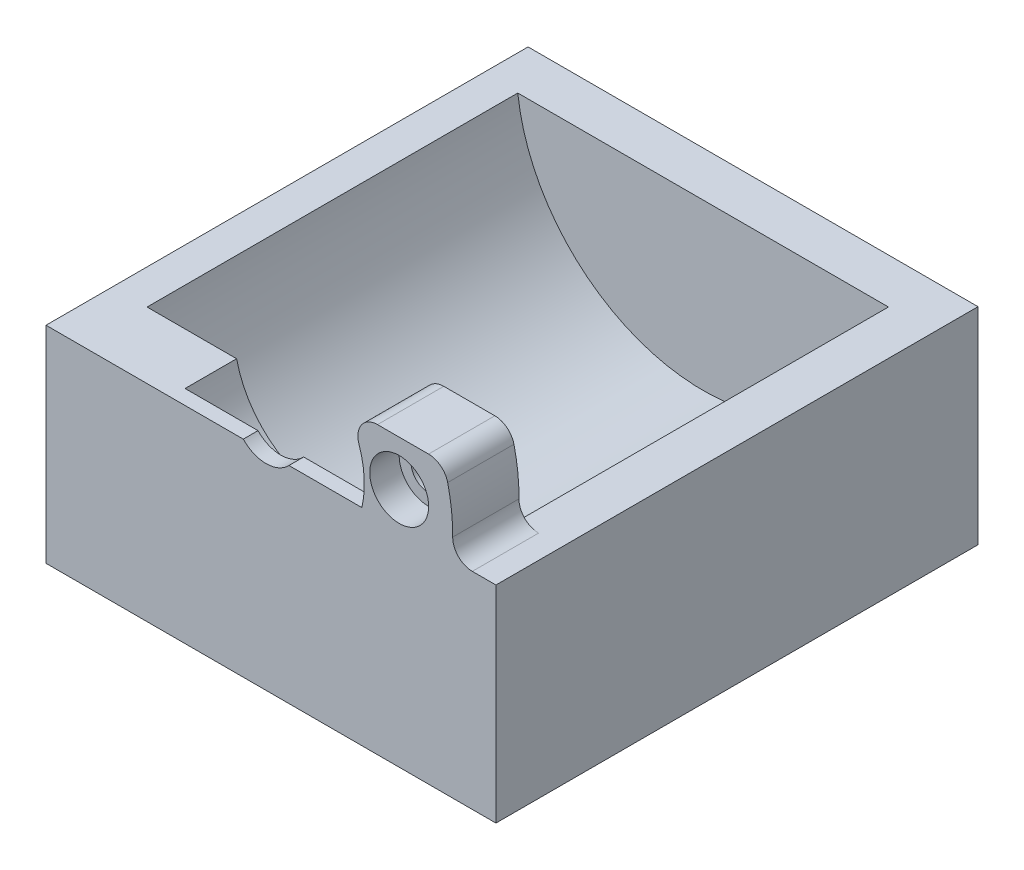
ISO-10303-21;
HEADER;
FILE_DESCRIPTION(('STEP AP214'),'2;1');
FILE_NAME('part.step','',(''),(''),'','','');
FILE_SCHEMA(('AUTOMOTIVE_DESIGN { 1 0 10303 214 1 1 1 1 }'));
ENDSEC;
DATA;
#1=APPLICATION_CONTEXT('core data for automotive mechanical design processes');
#2=APPLICATION_PROTOCOL_DEFINITION('international standard','automotive_design',2000,#1);
#3=PRODUCT_CONTEXT('',#1,'mechanical');
#4=PRODUCT('Part','Part','',(#3));
#5=PRODUCT_RELATED_PRODUCT_CATEGORY('part','',(#4));
#6=PRODUCT_DEFINITION_FORMATION('','',#4);
#7=PRODUCT_DEFINITION_CONTEXT('part definition',#1,'design');
#8=PRODUCT_DEFINITION('design','',#6,#7);
#9=PRODUCT_DEFINITION_SHAPE('','',#8);
#10=(LENGTH_UNIT() NAMED_UNIT(*) SI_UNIT(.MILLI.,.METRE.));
#11=(NAMED_UNIT(*) PLANE_ANGLE_UNIT() SI_UNIT($,.RADIAN.));
#12=(NAMED_UNIT(*) SI_UNIT($,.STERADIAN.) SOLID_ANGLE_UNIT());
#13=UNCERTAINTY_MEASURE_WITH_UNIT(LENGTH_MEASURE(1.E-05),#10,'distance_accuracy_value','');
#14=(GEOMETRIC_REPRESENTATION_CONTEXT(3) GLOBAL_UNCERTAINTY_ASSIGNED_CONTEXT((#13)) GLOBAL_UNIT_ASSIGNED_CONTEXT((#10,
#11,#12)) REPRESENTATION_CONTEXT('',''));
#15=CARTESIAN_POINT('',(0.,0.,0.));
#16=DIRECTION('',(0.,0.,1.));
#17=DIRECTION('',(1.,0.,0.));
#18=AXIS2_PLACEMENT_3D('',#15,#16,#17);
#19=CARTESIAN_POINT('',(-10.,0.,80.));
#20=DIRECTION('',(0.,0.,1.));
#21=DIRECTION('',(1.,0.,0.));
#22=AXIS2_PLACEMENT_3D('',#19,#20,#21);
#23=PLANE('',#22);
#24=DIRECTION('',(0.,-1.,0.));
#25=VECTOR('',#24,1.);
#26=CARTESIAN_POINT('',(69.7037540720334,60.4384133611691,80.));
#27=LINE('',#26,#25);
#28=CARTESIAN_POINT('',(69.7037540720334,10.4384133611691,80.));
#29=VERTEX_POINT('',#28);
#30=CARTESIAN_POINT('',(69.7037540720334,-10.5615866388309,80.));
#31=VERTEX_POINT('',#30);
#32=EDGE_CURVE('E206',#29,#31,#27,.T.);
#33=ORIENTED_EDGE('',*,*,#32,.T.);
#34=DIRECTION('',(-1.,0.,0.));
#35=VECTOR('',#34,1.);
#36=CARTESIAN_POINT('',(115.522386605031,-10.5615866388309,80.));
#37=LINE('',#36,#35);
#38=CARTESIAN_POINT('',(115.522386605031,-10.5615866388309,80.));
#39=VERTEX_POINT('',#38);
#40=EDGE_CURVE('E183',#39,#31,#37,.T.);
#41=ORIENTED_EDGE('',*,*,#40,.F.);
#42=DIRECTION('',(0.,-1.,0.));
#43=VECTOR('',#42,1.);
#44=CARTESIAN_POINT('',(115.522386605031,60.4384133611691,80.));
#45=LINE('',#44,#43);
#46=CARTESIAN_POINT('',(115.522386605031,10.4384133611691,80.));
#47=VERTEX_POINT('',#46);
#48=EDGE_CURVE('E203',#47,#39,#45,.T.);
#49=ORIENTED_EDGE('',*,*,#48,.F.);
#50=DIRECTION('',(-1.,0.,0.));
#51=VECTOR('',#50,1.);
#52=CARTESIAN_POINT('',(-92.8810020876827,10.4384133611691,80.));
#53=LINE('',#52,#51);
#54=CARTESIAN_POINT('',(113.118045509768,10.4384133611691,80.));
#55=VERTEX_POINT('',#54);
#56=EDGE_CURVE('E285',#47,#55,#53,.T.);
#57=ORIENTED_EDGE('',*,*,#56,.T.);
#58=CARTESIAN_POINT('',(113.118045509768,12.4384133611691,80.));
#59=DIRECTION('',(0.,0.,1.));
#60=DIRECTION('',(1.,0.,0.));
#61=AXIS2_PLACEMENT_3D('',#58,#59,#60);
#62=CIRCLE('',#61,2.);
#63=CARTESIAN_POINT('',(111.118136214773,12.4574609802167,80.));
#64=VERTEX_POINT('',#63);
#65=EDGE_CURVE('E329',#55,#64,#62,.F.);
#66=ORIENTED_EDGE('',*,*,#65,.T.);
#67=CARTESIAN_POINT('',(92.1189979123148,12.6384133611689,80.));
#68=DIRECTION('',(0.,0.,1.));
#69=DIRECTION('',(-1.,0.,0.));
#70=AXIS2_PLACEMENT_3D('',#67,#68,#69);
#71=CIRCLE('',#70,19.0000000000024);
#72=CARTESIAN_POINT('',(110.608046564802,17.0150650409405,80.));
#73=VERTEX_POINT('',#72);
#74=EDGE_CURVE('E227',#64,#73,#71,.T.);
#75=ORIENTED_EDGE('',*,*,#74,.T.);
#76=CARTESIAN_POINT('',(108.661830917172,16.5543648641225,80.));
#77=DIRECTION('',(0.,0.,1.));
#78=DIRECTION('',(1.,0.,0.));
#79=AXIS2_PLACEMENT_3D('',#76,#77,#78);
#80=CIRCLE('',#79,2.);
#81=CARTESIAN_POINT('',(108.661830917172,18.5543648641225,80.));
#82=VERTEX_POINT('',#81);
#83=EDGE_CURVE('E301',#73,#82,#80,.T.);
#84=ORIENTED_EDGE('',*,*,#83,.T.);
#85=DIRECTION('',(-1.,0.,0.));
#86=VECTOR('',#85,1.);
#87=CARTESIAN_POINT('',(100.181349790938,18.5543648641225,80.));
#88=LINE('',#87,#86);
#89=CARTESIAN_POINT('',(103.462071738513,18.5543648641225,80.));
#90=VERTEX_POINT('',#89);
#91=EDGE_CURVE('E223',#82,#90,#88,.T.);
#92=ORIENTED_EDGE('',*,*,#91,.T.);
#93=CARTESIAN_POINT('',(103.462071738513,16.5543648641225,80.));
#94=DIRECTION('',(0.,0.,1.));
#95=DIRECTION('',(1.,0.,0.));
#96=AXIS2_PLACEMENT_3D('',#93,#94,#95);
#97=CIRCLE('',#96,2.);
#98=CARTESIAN_POINT('',(101.571559434147,15.9017062802969,80.));
#99=VERTEX_POINT('',#98);
#100=EDGE_CURVE('E304',#90,#99,#97,.T.);
#101=ORIENTED_EDGE('',*,*,#100,.T.);
#102=CARTESIAN_POINT('',(92.1189979123168,12.638413361169,80.));
#103=DIRECTION('',(0.,0.,-1.));
#104=DIRECTION('',(-1.,0.,0.));
#105=AXIS2_PLACEMENT_3D('',#102,#103,#104);
#106=CIRCLE('',#105,10.0000000000004);
#107=CARTESIAN_POINT('',(101.873996630923,10.4384133611691,80.));
#108=VERTEX_POINT('',#107);
#109=EDGE_CURVE('E232',#99,#108,#106,.T.);
#110=ORIENTED_EDGE('',*,*,#109,.T.);
#111=CARTESIAN_POINT('',(94.4427879200417,10.4384133611691,80.));
#112=VERTEX_POINT('',#111);
#113=EDGE_CURVE('E289',#108,#112,#53,.T.);
#114=ORIENTED_EDGE('',*,*,#113,.T.);
#115=CARTESIAN_POINT('',(92.1189979123173,12.6384133611691,80.));
#116=DIRECTION('',(0.,0.,1.));
#117=DIRECTION('',(1.,0.,0.));
#118=AXIS2_PLACEMENT_3D('',#115,#116,#117);
#119=CIRCLE('',#118,3.2);
#120=CARTESIAN_POINT('',(89.7952079045928,10.4384133611691,80.));
#121=VERTEX_POINT('',#120);
#122=EDGE_CURVE('E248',#121,#112,#119,.T.);
#123=ORIENTED_EDGE('',*,*,#122,.F.);
#124=EDGE_CURVE('E284',#121,#29,#53,.T.);
#125=ORIENTED_EDGE('',*,*,#124,.T.);
#126=EDGE_LOOP('',(#33,#41,#49,#57,#66,#75,#84,#92,#101,#110,#114,#123,#125));
#127=FACE_BOUND('',#126,.T.);
#128=CARTESIAN_POINT('',(105.669337757458,13.9384133611691,80.));
#129=DIRECTION('',(0.,0.,1.));
#130=DIRECTION('',(1.,0.,0.));
#131=AXIS2_PLACEMENT_3D('',#128,#129,#130);
#132=CIRCLE('',#131,3.00000000000001);
#133=CARTESIAN_POINT('',(108.669337757458,13.9384133611691,80.));
#134=VERTEX_POINT('',#133);
#135=EDGE_CURVE('E210',#134,#134,#132,.T.);
#136=ORIENTED_EDGE('',*,*,#135,.F.);
#137=EDGE_LOOP('',(#136));
#138=FACE_BOUND('',#137,.T.);
#139=ADVANCED_FACE('F51',(#127,#138),#23,.T.);
#140=CARTESIAN_POINT('',(-92.8810020876827,10.4384133611691,80.));
#141=DIRECTION('',(0.,-1.,0.));
#142=DIRECTION('',(0.,0.,-1.));
#143=AXIS2_PLACEMENT_3D('',#140,#141,#142);
#144=PLANE('',#143);
#145=DIRECTION('',(-1.,0.,0.));
#146=VECTOR('',#145,1.);
#147=CARTESIAN_POINT('',(73.2467961329805,10.4384133611691,35.5));
#148=LINE('',#147,#146);
#149=CARTESIAN_POINT('',(110.991199691654,10.4384133611691,35.5));
#150=VERTEX_POINT('',#149);
#151=CARTESIAN_POINT('',(73.2467961329805,10.4384133611691,35.5));
#152=VERTEX_POINT('',#151);
#153=EDGE_CURVE('E345',#150,#152,#148,.T.);
#154=ORIENTED_EDGE('',*,*,#153,.F.);
#155=DIRECTION('',(0.,0.,1.));
#156=VECTOR('',#155,1.);
#157=CARTESIAN_POINT('',(110.991199691654,10.4384133611691,38.5));
#158=LINE('',#157,#156);
#159=CARTESIAN_POINT('',(110.991199691654,10.4384133611691,73.25));
#160=VERTEX_POINT('',#159);
#161=EDGE_CURVE('E281',#150,#160,#158,.T.);
#162=ORIENTED_EDGE('',*,*,#161,.T.);
#163=DIRECTION('',(1.,0.,0.));
#164=VECTOR('',#163,1.);
#165=CARTESIAN_POINT('',(92.1189979123173,10.4384133611691,73.25));
#166=LINE('',#165,#164);
#167=CARTESIAN_POINT('',(113.118045509768,10.4384133611691,73.25));
#168=VERTEX_POINT('',#167);
#169=EDGE_CURVE('E67',#160,#168,#166,.T.);
#170=ORIENTED_EDGE('',*,*,#169,.T.);
#171=DIRECTION('',(0.,0.,1.));
#172=VECTOR('',#171,1.);
#173=CARTESIAN_POINT('',(113.118045509768,10.4384133611691,80.));
#174=LINE('',#173,#172);
#175=EDGE_CURVE('E318',#168,#55,#174,.T.);
#176=ORIENTED_EDGE('',*,*,#175,.T.);
#177=ORIENTED_EDGE('',*,*,#56,.F.);
#178=DIRECTION('',(0.,0.,-1.));
#179=VECTOR('',#178,1.);
#180=CARTESIAN_POINT('',(115.522386605031,10.4384133611691,80.));
#181=LINE('',#180,#179);
#182=CARTESIAN_POINT('',(115.522386605031,10.4384133611691,30.9091006022906));
#183=VERTEX_POINT('',#182);
#184=EDGE_CURVE('E60',#47,#183,#181,.T.);
#185=ORIENTED_EDGE('',*,*,#184,.T.);
#186=DIRECTION('',(1.,0.,0.));
#187=VECTOR('',#186,1.);
#188=CARTESIAN_POINT('',(69.7037540720334,10.4384133611691,30.9091006022906));
#189=LINE('',#188,#187);
#190=CARTESIAN_POINT('',(69.7037540720334,10.4384133611691,30.9091006022906));
#191=VERTEX_POINT('',#190);
#192=EDGE_CURVE('E195',#191,#183,#189,.T.);
#193=ORIENTED_EDGE('',*,*,#192,.F.);
#194=DIRECTION('',(0.,0.,-1.));
#195=VECTOR('',#194,1.);
#196=CARTESIAN_POINT('',(69.7037540720334,10.4384133611691,80.));
#197=LINE('',#196,#195);
#198=EDGE_CURVE('E11',#29,#191,#197,.T.);
#199=ORIENTED_EDGE('',*,*,#198,.F.);
#200=ORIENTED_EDGE('',*,*,#124,.F.);
#201=DIRECTION('',(0.,0.,-1.));
#202=VECTOR('',#201,1.);
#203=CARTESIAN_POINT('',(89.7952079045928,10.4384133611691,118.5));
#204=LINE('',#203,#202);
#205=CARTESIAN_POINT('',(89.7952079045928,10.4384133611691,78.5));
#206=VERTEX_POINT('',#205);
#207=EDGE_CURVE('E256',#121,#206,#204,.T.);
#208=ORIENTED_EDGE('',*,*,#207,.T.);
#209=DIRECTION('',(1.,0.,0.));
#210=VECTOR('',#209,1.);
#211=CARTESIAN_POINT('',(-92.8810020876827,10.4384133611691,78.5));
#212=LINE('',#211,#210);
#213=CARTESIAN_POINT('',(82.3639991937115,10.4384133611691,78.5));
#214=VERTEX_POINT('',#213);
#215=EDGE_CURVE('E290',#214,#206,#212,.T.);
#216=ORIENTED_EDGE('',*,*,#215,.F.);
#217=DIRECTION('',(0.,0.,-1.));
#218=VECTOR('',#217,1.);
#219=CARTESIAN_POINT('',(82.3639991937115,10.4384133611691,78.5));
#220=LINE('',#219,#218);
#221=CARTESIAN_POINT('',(82.3639991937115,10.4384133611691,73.25));
#222=VERTEX_POINT('',#221);
#223=EDGE_CURVE('E265',#214,#222,#220,.T.);
#224=ORIENTED_EDGE('',*,*,#223,.T.);
#225=DIRECTION('',(-1.,0.,0.));
#226=VECTOR('',#225,1.);
#227=CARTESIAN_POINT('',(73.2467961329805,10.4384133611691,73.25));
#228=LINE('',#227,#226);
#229=CARTESIAN_POINT('',(73.2467961329805,10.4384133611691,73.25));
#230=VERTEX_POINT('',#229);
#231=EDGE_CURVE('E271',#222,#230,#228,.T.);
#232=ORIENTED_EDGE('',*,*,#231,.T.);
#233=DIRECTION('',(0.,0.,1.));
#234=VECTOR('',#233,1.);
#235=CARTESIAN_POINT('',(73.2467961329805,10.4384133611691,38.5));
#236=LINE('',#235,#234);
#237=EDGE_CURVE('E278',#230,#152,#236,.F.);
#238=ORIENTED_EDGE('',*,*,#237,.T.);
#239=EDGE_LOOP('',(#154,#162,#170,#176,#177,#185,#193,#199,#200,#208,#216,#224,#232,#238));
#240=FACE_BOUND('',#239,.T.);
#241=ADVANCED_FACE('F340',(#240),#144,.F.);
#242=CARTESIAN_POINT('',(105.669337757458,13.9384133611691,73.25));
#243=DIRECTION('',(0.,0.,1.));
#244=DIRECTION('',(1.,0.,0.));
#245=AXIS2_PLACEMENT_3D('',#242,#243,#244);
#246=CYLINDRICAL_SURFACE('',#245,1.79999999999999);
#247=CARTESIAN_POINT('',(105.669337757458,13.9384133611691,73.25));
#248=DIRECTION('',(0.,0.,1.));
#249=DIRECTION('',(1.,0.,0.));
#250=AXIS2_PLACEMENT_3D('',#247,#248,#249);
#251=CIRCLE('',#250,1.79999999999999);
#252=CARTESIAN_POINT('',(107.469337757458,13.9384133611691,73.25));
#253=VERTEX_POINT('',#252);
#254=EDGE_CURVE('E235',#253,#253,#251,.T.);
#255=ORIENTED_EDGE('',*,*,#254,.F.);
#256=EDGE_LOOP('',(#255));
#257=FACE_BOUND('',#256,.T.);
#258=CARTESIAN_POINT('',(105.669337757458,13.9384133611691,77.));
#259=DIRECTION('',(0.,0.,1.));
#260=DIRECTION('',(1.,0.,0.));
#261=AXIS2_PLACEMENT_3D('',#258,#259,#260);
#262=CIRCLE('',#261,1.79999999999999);
#263=CARTESIAN_POINT('',(107.469337757458,13.9384133611691,77.));
#264=VERTEX_POINT('',#263);
#265=EDGE_CURVE('E214',#264,#264,#262,.F.);
#266=ORIENTED_EDGE('',*,*,#265,.F.);
#267=EDGE_LOOP('',(#266));
#268=FACE_BOUND('',#267,.T.);
#269=ADVANCED_FACE('F419',(#257,#268),#246,.F.);
#270=CARTESIAN_POINT('',(92.1189979123173,12.6384133611691,38.5));
#271=DIRECTION('',(0.,0.,1.));
#272=DIRECTION('',(1.,0.,0.));
#273=AXIS2_PLACEMENT_3D('',#270,#271,#272);
#274=CYLINDRICAL_SURFACE('',#273,19.);
#275=CARTESIAN_POINT('',(92.1189979123173,12.6384133611691,73.25));
#276=DIRECTION('',(0.,0.,1.));
#277=DIRECTION('',(1.,0.,0.));
#278=AXIS2_PLACEMENT_3D('',#275,#276,#277);
#279=CIRCLE('',#278,19.);
#280=EDGE_CURVE('E274',#230,#160,#279,.T.);
#281=ORIENTED_EDGE('',*,*,#280,.T.);
#282=ORIENTED_EDGE('',*,*,#161,.F.);
#283=CARTESIAN_POINT('',(92.1189979123173,12.6384133611691,35.5));
#284=DIRECTION('',(0.,0.,1.));
#285=DIRECTION('',(1.,0.,0.));
#286=AXIS2_PLACEMENT_3D('',#283,#284,#285);
#287=CIRCLE('',#286,19.);
#288=EDGE_CURVE('E185',#152,#150,#287,.T.);
#289=ORIENTED_EDGE('',*,*,#288,.F.);
#290=ORIENTED_EDGE('',*,*,#237,.F.);
#291=EDGE_LOOP('',(#281,#282,#289,#290));
#292=FACE_BOUND('',#291,.T.);
#293=ADVANCED_FACE('F424',(#292),#274,.F.);
#294=CARTESIAN_POINT('',(92.1189979123173,12.6384133611691,73.25));
#295=DIRECTION('',(0.,0.,1.));
#296=DIRECTION('',(1.,0.,0.));
#297=AXIS2_PLACEMENT_3D('',#294,#295,#296);
#298=PLANE('',#297);
#299=CARTESIAN_POINT('',(92.1189979123173,12.6384133611691,73.25));
#300=DIRECTION('',(0.,0.,-1.));
#301=DIRECTION('',(-1.,0.,0.));
#302=AXIS2_PLACEMENT_3D('',#299,#300,#301);
#303=CIRCLE('',#302,9.99999999999999);
#304=CARTESIAN_POINT('',(101.571559434147,15.901706280297,73.25));
#305=VERTEX_POINT('',#304);
#306=EDGE_CURVE('E260',#305,#222,#303,.T.);
#307=ORIENTED_EDGE('',*,*,#306,.F.);
#308=CARTESIAN_POINT('',(103.462071738513,16.5543648641225,73.25));
#309=DIRECTION('',(0.,0.,1.));
#310=DIRECTION('',(1.,0.,0.));
#311=AXIS2_PLACEMENT_3D('',#308,#309,#310);
#312=CIRCLE('',#311,2.);
#313=CARTESIAN_POINT('',(103.462071738513,18.5543648641225,73.25));
#314=VERTEX_POINT('',#313);
#315=EDGE_CURVE('E313',#305,#314,#312,.F.);
#316=ORIENTED_EDGE('',*,*,#315,.T.);
#317=DIRECTION('',(-1.,0.,0.));
#318=VECTOR('',#317,1.);
#319=CARTESIAN_POINT('',(100.181349790938,18.5543648641225,73.25));
#320=LINE('',#319,#318);
#321=CARTESIAN_POINT('',(108.661830917172,18.5543648641225,73.25));
#322=VERTEX_POINT('',#321);
#323=EDGE_CURVE('E222',#322,#314,#320,.T.);
#324=ORIENTED_EDGE('',*,*,#323,.F.);
#325=CARTESIAN_POINT('',(108.661830917172,16.5543648641225,73.25));
#326=DIRECTION('',(0.,0.,1.));
#327=DIRECTION('',(1.,0.,0.));
#328=AXIS2_PLACEMENT_3D('',#325,#326,#327);
#329=CIRCLE('',#328,2.);
#330=CARTESIAN_POINT('',(110.608046564802,17.0150650409405,73.25));
#331=VERTEX_POINT('',#330);
#332=EDGE_CURVE('E310',#322,#331,#329,.F.);
#333=ORIENTED_EDGE('',*,*,#332,.T.);
#334=CARTESIAN_POINT('',(92.1189979123148,12.6384133611689,73.25));
#335=DIRECTION('',(0.,0.,1.));
#336=DIRECTION('',(-1.,0.,0.));
#337=AXIS2_PLACEMENT_3D('',#334,#335,#336);
#338=CIRCLE('',#337,19.0000000000024);
#339=CARTESIAN_POINT('',(111.118136214773,12.4574609802167,73.25));
#340=VERTEX_POINT('',#339);
#341=EDGE_CURVE('E228',#340,#331,#338,.T.);
#342=ORIENTED_EDGE('',*,*,#341,.F.);
#343=CARTESIAN_POINT('',(113.118045509768,12.4384133611691,73.25));
#344=DIRECTION('',(0.,0.,1.));
#345=DIRECTION('',(1.,0.,0.));
#346=AXIS2_PLACEMENT_3D('',#343,#344,#345);
#347=CIRCLE('',#346,2.);
#348=EDGE_CURVE('E72',#340,#168,#347,.T.);
#349=ORIENTED_EDGE('',*,*,#348,.T.);
#350=ORIENTED_EDGE('',*,*,#169,.F.);
#351=ORIENTED_EDGE('',*,*,#280,.F.);
#352=ORIENTED_EDGE('',*,*,#231,.F.);
#353=EDGE_LOOP('',(#307,#316,#324,#333,#342,#349,#350,#351,#352));
#354=FACE_BOUND('',#353,.T.);
#355=ORIENTED_EDGE('',*,*,#254,.T.);
#356=EDGE_LOOP('',(#355));
#357=FACE_BOUND('',#356,.T.);
#358=ADVANCED_FACE('F454',(#354,#357),#298,.F.);
#359=CARTESIAN_POINT('',(92.1189979123173,12.6384133611691,78.5));
#360=DIRECTION('',(0.,0.,-1.));
#361=DIRECTION('',(-1.,0.,0.));
#362=AXIS2_PLACEMENT_3D('',#359,#360,#361);
#363=PLANE('',#362);
#364=CARTESIAN_POINT('',(92.1189979123173,12.6384133611691,78.5));
#365=DIRECTION('',(0.,0.,-1.));
#366=DIRECTION('',(-1.,0.,0.));
#367=AXIS2_PLACEMENT_3D('',#364,#365,#366);
#368=CIRCLE('',#367,3.2);
#369=CARTESIAN_POINT('',(94.4427879200417,10.4384133611691,78.5));
#370=VERTEX_POINT('',#369);
#371=EDGE_CURVE('E245',#370,#206,#368,.T.);
#372=ORIENTED_EDGE('',*,*,#371,.F.);
#373=CARTESIAN_POINT('',(101.873996630923,10.4384133611691,78.5));
#374=VERTEX_POINT('',#373);
#375=EDGE_CURVE('E288',#370,#374,#212,.T.);
#376=ORIENTED_EDGE('',*,*,#375,.T.);
#377=CARTESIAN_POINT('',(92.1189979123173,12.6384133611691,78.5));
#378=DIRECTION('',(0.,0.,-1.));
#379=DIRECTION('',(-1.,0.,0.));
#380=AXIS2_PLACEMENT_3D('',#377,#378,#379);
#381=CIRCLE('',#380,9.99999999999999);
#382=EDGE_CURVE('E261',#374,#214,#381,.T.);
#383=ORIENTED_EDGE('',*,*,#382,.T.);
#384=ORIENTED_EDGE('',*,*,#215,.T.);
#385=EDGE_LOOP('',(#372,#376,#383,#384));
#386=FACE_BOUND('',#385,.T.);
#387=ADVANCED_FACE('F463',(#386),#363,.T.);
#388=CARTESIAN_POINT('',(92.1189979123173,12.6384133611691,118.5));
#389=DIRECTION('',(0.,0.,-1.));
#390=DIRECTION('',(-1.,0.,0.));
#391=AXIS2_PLACEMENT_3D('',#388,#389,#390);
#392=CYLINDRICAL_SURFACE('',#391,3.2);
#393=ORIENTED_EDGE('',*,*,#122,.T.);
#394=DIRECTION('',(0.,0.,-1.));
#395=VECTOR('',#394,1.);
#396=CARTESIAN_POINT('',(94.4427879200417,10.4384133611691,118.5));
#397=LINE('',#396,#395);
#398=EDGE_CURVE('E252',#370,#112,#397,.F.);
#399=ORIENTED_EDGE('',*,*,#398,.F.);
#400=ORIENTED_EDGE('',*,*,#371,.T.);
#401=ORIENTED_EDGE('',*,*,#207,.F.);
#402=EDGE_LOOP('',(#393,#399,#400,#401));
#403=FACE_BOUND('',#402,.T.);
#404=ADVANCED_FACE('F485',(#403),#392,.F.);
#405=ORIENTED_EDGE('',*,*,#113,.F.);
#406=DIRECTION('',(0.,0.,1.));
#407=VECTOR('',#406,1.);
#408=CARTESIAN_POINT('',(101.873996630923,10.4384133611691,73.25));
#409=LINE('',#408,#407);
#410=EDGE_CURVE('E218',#374,#108,#409,.T.);
#411=ORIENTED_EDGE('',*,*,#410,.F.);
#412=ORIENTED_EDGE('',*,*,#375,.F.);
#413=ORIENTED_EDGE('',*,*,#398,.T.);
#414=EDGE_LOOP('',(#405,#411,#412,#413));
#415=FACE_BOUND('',#414,.T.);
#416=ADVANCED_FACE('F421',(#415),#144,.F.);
#417=CARTESIAN_POINT('',(92.1189979123173,12.6384133611691,78.5));
#418=DIRECTION('',(0.,0.,-1.));
#419=DIRECTION('',(-1.,0.,0.));
#420=AXIS2_PLACEMENT_3D('',#417,#418,#419);
#421=CYLINDRICAL_SURFACE('',#420,9.99999999999999);
#422=ORIENTED_EDGE('',*,*,#109,.F.);
#423=DIRECTION('',(0.,0.,-1.));
#424=VECTOR('',#423,1.);
#425=CARTESIAN_POINT('',(101.571559434147,15.901706280297,78.5));
#426=LINE('',#425,#424);
#427=EDGE_CURVE('E307',#99,#305,#426,.T.);
#428=ORIENTED_EDGE('',*,*,#427,.T.);
#429=ORIENTED_EDGE('',*,*,#306,.T.);
#430=ORIENTED_EDGE('',*,*,#223,.F.);
#431=ORIENTED_EDGE('',*,*,#382,.F.);
#432=ORIENTED_EDGE('',*,*,#410,.T.);
#433=EDGE_LOOP('',(#422,#428,#429,#430,#431,#432));
#434=FACE_BOUND('',#433,.T.);
#435=ADVANCED_FACE('F430',(#434),#421,.F.);
#436=CARTESIAN_POINT('',(103.462071738513,16.5543648641225,78.5));
#437=DIRECTION('',(0.,0.,-1.));
#438=DIRECTION('',(-1.,0.,0.));
#439=AXIS2_PLACEMENT_3D('',#436,#437,#438);
#440=CYLINDRICAL_SURFACE('',#439,2.);
#441=ORIENTED_EDGE('',*,*,#315,.F.);
#442=ORIENTED_EDGE('',*,*,#427,.F.);
#443=ORIENTED_EDGE('',*,*,#100,.F.);
#444=DIRECTION('',(0.,0.,1.));
#445=VECTOR('',#444,1.);
#446=CARTESIAN_POINT('',(103.462071738513,18.5543648641225,80.));
#447=LINE('',#446,#445);
#448=EDGE_CURVE('E297',#314,#90,#447,.T.);
#449=ORIENTED_EDGE('',*,*,#448,.F.);
#450=EDGE_LOOP('',(#441,#442,#443,#449));
#451=FACE_BOUND('',#450,.T.);
#452=ADVANCED_FACE('F427',(#451),#440,.T.);
#453=CARTESIAN_POINT('',(100.181349790938,18.5543648641225,73.25));
#454=DIRECTION('',(0.,1.,0.));
#455=DIRECTION('',(0.,0.,1.));
#456=AXIS2_PLACEMENT_3D('',#453,#454,#455);
#457=PLANE('',#456);
#458=ORIENTED_EDGE('',*,*,#323,.T.);
#459=ORIENTED_EDGE('',*,*,#448,.T.);
#460=ORIENTED_EDGE('',*,*,#91,.F.);
#461=DIRECTION('',(0.,0.,1.));
#462=VECTOR('',#461,1.);
#463=CARTESIAN_POINT('',(108.661830917172,18.5543648641225,73.25));
#464=LINE('',#463,#462);
#465=EDGE_CURVE('E294',#82,#322,#464,.F.);
#466=ORIENTED_EDGE('',*,*,#465,.T.);
#467=EDGE_LOOP('',(#458,#459,#460,#466));
#468=FACE_BOUND('',#467,.T.);
#469=ADVANCED_FACE('F429',(#468),#457,.T.);
#470=CARTESIAN_POINT('',(108.661830917172,16.5543648641225,73.25));
#471=DIRECTION('',(0.,0.,1.));
#472=DIRECTION('',(1.,0.,0.));
#473=AXIS2_PLACEMENT_3D('',#470,#471,#472);
#474=CYLINDRICAL_SURFACE('',#473,2.);
#475=ORIENTED_EDGE('',*,*,#332,.F.);
#476=ORIENTED_EDGE('',*,*,#465,.F.);
#477=ORIENTED_EDGE('',*,*,#83,.F.);
#478=DIRECTION('',(0.,0.,1.));
#479=VECTOR('',#478,1.);
#480=CARTESIAN_POINT('',(110.608046564802,17.0150650409405,73.25));
#481=LINE('',#480,#479);
#482=EDGE_CURVE('E322',#331,#73,#481,.T.);
#483=ORIENTED_EDGE('',*,*,#482,.F.);
#484=EDGE_LOOP('',(#475,#476,#477,#483));
#485=FACE_BOUND('',#484,.T.);
#486=ADVANCED_FACE('F53',(#485),#474,.T.);
#487=CARTESIAN_POINT('',(92.1189979123148,12.6384133611689,73.25));
#488=DIRECTION('',(0.,0.,1.));
#489=DIRECTION('',(1.,0.,0.));
#490=AXIS2_PLACEMENT_3D('',#487,#488,#489);
#491=CYLINDRICAL_SURFACE('',#490,19.0000000000024);
#492=ORIENTED_EDGE('',*,*,#74,.F.);
#493=DIRECTION('',(0.,0.,1.));
#494=VECTOR('',#493,1.);
#495=CARTESIAN_POINT('',(111.118136214773,12.4574609802167,73.25));
#496=LINE('',#495,#494);
#497=EDGE_CURVE('E326',#64,#340,#496,.F.);
#498=ORIENTED_EDGE('',*,*,#497,.T.);
#499=ORIENTED_EDGE('',*,*,#341,.T.);
#500=ORIENTED_EDGE('',*,*,#482,.T.);
#501=EDGE_LOOP('',(#492,#498,#499,#500));
#502=FACE_BOUND('',#501,.T.);
#503=ADVANCED_FACE('F435',(#502),#491,.T.);
#504=CARTESIAN_POINT('',(113.118045509768,12.4384133611691,73.25));
#505=DIRECTION('',(0.,0.,1.));
#506=DIRECTION('',(1.,0.,0.));
#507=AXIS2_PLACEMENT_3D('',#504,#505,#506);
#508=CYLINDRICAL_SURFACE('',#507,2.);
#509=ORIENTED_EDGE('',*,*,#348,.F.);
#510=ORIENTED_EDGE('',*,*,#497,.F.);
#511=ORIENTED_EDGE('',*,*,#65,.F.);
#512=ORIENTED_EDGE('',*,*,#175,.F.);
#513=EDGE_LOOP('',(#509,#510,#511,#512));
#514=FACE_BOUND('',#513,.T.);
#515=ADVANCED_FACE('F432',(#514),#508,.F.);
#516=CARTESIAN_POINT('',(105.669337757458,13.9384133611691,77.));
#517=DIRECTION('',(0.,0.,1.));
#518=DIRECTION('',(1.,0.,0.));
#519=AXIS2_PLACEMENT_3D('',#516,#517,#518);
#520=PLANE('',#519);
#521=CARTESIAN_POINT('',(105.669337757458,13.9384133611691,77.));
#522=DIRECTION('',(0.,0.,1.));
#523=DIRECTION('',(1.,0.,0.));
#524=AXIS2_PLACEMENT_3D('',#521,#522,#523);
#525=CIRCLE('',#524,3.00000000000001);
#526=CARTESIAN_POINT('',(108.669337757458,13.9384133611691,77.));
#527=VERTEX_POINT('',#526);
#528=EDGE_CURVE('E209',#527,#527,#525,.T.);
#529=ORIENTED_EDGE('',*,*,#528,.T.);
#530=EDGE_LOOP('',(#529));
#531=FACE_BOUND('',#530,.T.);
#532=ORIENTED_EDGE('',*,*,#265,.T.);
#533=EDGE_LOOP('',(#532));
#534=FACE_BOUND('',#533,.T.);
#535=ADVANCED_FACE('F434',(#531,#534),#520,.T.);
#536=CARTESIAN_POINT('',(105.669337757458,13.9384133611691,77.));
#537=DIRECTION('',(0.,0.,1.));
#538=DIRECTION('',(1.,0.,0.));
#539=AXIS2_PLACEMENT_3D('',#536,#537,#538);
#540=CYLINDRICAL_SURFACE('',#539,3.00000000000001);
#541=ORIENTED_EDGE('',*,*,#528,.F.);
#542=EDGE_LOOP('',(#541));
#543=FACE_BOUND('',#542,.T.);
#544=ORIENTED_EDGE('',*,*,#135,.T.);
#545=EDGE_LOOP('',(#544));
#546=FACE_BOUND('',#545,.T.);
#547=ADVANCED_FACE('F441',(#543,#546),#540,.F.);
#548=CARTESIAN_POINT('',(69.7037540720334,60.4384133611691,0.));
#549=DIRECTION('',(-1.,0.,0.));
#550=DIRECTION('',(0.,0.,1.));
#551=AXIS2_PLACEMENT_3D('',#548,#549,#550);
#552=PLANE('',#551);
#553=DIRECTION('',(0.,1.,0.));
#554=VECTOR('',#553,1.);
#555=CARTESIAN_POINT('',(69.7037540720334,3.43841336116911,30.9091006022906));
#556=LINE('',#555,#554);
#557=CARTESIAN_POINT('',(69.7037540720334,-10.5615866388309,30.9091006022906));
#558=VERTEX_POINT('',#557);
#559=EDGE_CURVE('E164',#558,#191,#556,.T.);
#560=ORIENTED_EDGE('',*,*,#559,.F.);
#561=DIRECTION('',(0.,0.,1.));
#562=VECTOR('',#561,1.);
#563=CARTESIAN_POINT('',(69.7037540720334,-10.5615866388309,0.));
#564=LINE('',#563,#562);
#565=EDGE_CURVE('E167',#558,#31,#564,.T.);
#566=ORIENTED_EDGE('',*,*,#565,.T.);
#567=ORIENTED_EDGE('',*,*,#32,.F.);
#568=ORIENTED_EDGE('',*,*,#198,.T.);
#569=EDGE_LOOP('',(#560,#566,#567,#568));
#570=FACE_BOUND('',#569,.T.);
#571=ADVANCED_FACE('F166',(#570),#552,.T.);
#572=CARTESIAN_POINT('',(115.522386605031,60.4384133611691,0.));
#573=DIRECTION('',(-1.,0.,0.));
#574=DIRECTION('',(0.,0.,1.));
#575=AXIS2_PLACEMENT_3D('',#572,#573,#574);
#576=PLANE('',#575);
#577=DIRECTION('',(0.,0.,1.));
#578=VECTOR('',#577,1.);
#579=CARTESIAN_POINT('',(115.522386605031,-10.5615866388309,34.9091006022906));
#580=LINE('',#579,#578);
#581=CARTESIAN_POINT('',(115.522386605031,-10.5615866388309,30.9091006022906));
#582=VERTEX_POINT('',#581);
#583=EDGE_CURVE('E175',#582,#39,#580,.T.);
#584=ORIENTED_EDGE('',*,*,#583,.F.);
#585=DIRECTION('',(0.,-1.,0.));
#586=VECTOR('',#585,1.);
#587=CARTESIAN_POINT('',(115.522386605031,10.4384133611691,30.9091006022906));
#588=LINE('',#587,#586);
#589=EDGE_CURVE('E191',#183,#582,#588,.T.);
#590=ORIENTED_EDGE('',*,*,#589,.F.);
#591=ORIENTED_EDGE('',*,*,#184,.F.);
#592=ORIENTED_EDGE('',*,*,#48,.T.);
#593=EDGE_LOOP('',(#584,#590,#591,#592));
#594=FACE_BOUND('',#593,.T.);
#595=ADVANCED_FACE('F343',(#594),#576,.F.);
#596=CARTESIAN_POINT('',(0.,-10.5615866388309,0.));
#597=DIRECTION('',(0.,-1.,0.));
#598=DIRECTION('',(0.,0.,-1.));
#599=AXIS2_PLACEMENT_3D('',#596,#597,#598);
#600=PLANE('',#599);
#601=CARTESIAN_POINT('',(80.2137540720337,-10.5615866388309,43.05));
#602=DIRECTION('',(0.,-1.,0.));
#603=DIRECTION('',(0.,0.,-1.));
#604=AXIS2_PLACEMENT_3D('',#601,#602,#603);
#605=CIRCLE('',#604,3.25000000000001);
#606=CARTESIAN_POINT('',(80.2137540720337,-10.5615866388309,39.8));
#607=VERTEX_POINT('',#606);
#608=EDGE_CURVE('E373',#607,#607,#605,.T.);
#609=ORIENTED_EDGE('',*,*,#608,.F.);
#610=EDGE_LOOP('',(#609));
#611=FACE_BOUND('',#610,.T.);
#612=CARTESIAN_POINT('',(105.013754072034,-10.5615866388309,43.05));
#613=DIRECTION('',(0.,-1.,0.));
#614=DIRECTION('',(0.,0.,-1.));
#615=AXIS2_PLACEMENT_3D('',#612,#613,#614);
#616=CIRCLE('',#615,3.25000000000001);
#617=CARTESIAN_POINT('',(105.013754072034,-10.5615866388309,39.8));
#618=VERTEX_POINT('',#617);
#619=EDGE_CURVE('E365',#618,#618,#616,.T.);
#620=ORIENTED_EDGE('',*,*,#619,.F.);
#621=EDGE_LOOP('',(#620));
#622=FACE_BOUND('',#621,.T.);
#623=CARTESIAN_POINT('',(105.013754072033,-10.5615866388309,67.85));
#624=DIRECTION('',(0.,-1.,0.));
#625=DIRECTION('',(0.,0.,-1.));
#626=AXIS2_PLACEMENT_3D('',#623,#624,#625);
#627=CIRCLE('',#626,3.25000000000001);
#628=CARTESIAN_POINT('',(105.013754072033,-10.5615866388309,64.6));
#629=VERTEX_POINT('',#628);
#630=EDGE_CURVE('E357',#629,#629,#627,.T.);
#631=ORIENTED_EDGE('',*,*,#630,.F.);
#632=EDGE_LOOP('',(#631));
#633=FACE_BOUND('',#632,.T.);
#634=CARTESIAN_POINT('',(80.2137540720334,-10.5615866388309,67.85));
#635=DIRECTION('',(0.,-1.,0.));
#636=DIRECTION('',(0.,0.,-1.));
#637=AXIS2_PLACEMENT_3D('',#634,#635,#636);
#638=CIRCLE('',#637,3.25000000000001);
#639=CARTESIAN_POINT('',(80.2137540720334,-10.5615866388309,64.6));
#640=VERTEX_POINT('',#639);
#641=EDGE_CURVE('E353',#640,#640,#638,.T.);
#642=ORIENTED_EDGE('',*,*,#641,.F.);
#643=EDGE_LOOP('',(#642));
#644=FACE_BOUND('',#643,.T.);
#645=ORIENTED_EDGE('',*,*,#565,.F.);
#646=DIRECTION('',(-1.,0.,0.));
#647=VECTOR('',#646,1.);
#648=CARTESIAN_POINT('',(115.522386605031,-10.5615866388309,30.9091006022906));
#649=LINE('',#648,#647);
#650=EDGE_CURVE('E176',#582,#558,#649,.T.);
#651=ORIENTED_EDGE('',*,*,#650,.F.);
#652=ORIENTED_EDGE('',*,*,#583,.T.);
#653=ORIENTED_EDGE('',*,*,#40,.T.);
#654=EDGE_LOOP('',(#645,#651,#652,#653));
#655=FACE_BOUND('',#654,.T.);
#656=ADVANCED_FACE('F180',(#611,#622,#633,#644,#655),#600,.T.);
#657=CARTESIAN_POINT('',(0.,0.,30.9091006022906));
#658=DIRECTION('',(0.,0.,-1.));
#659=DIRECTION('',(-1.,0.,0.));
#660=AXIS2_PLACEMENT_3D('',#657,#658,#659);
#661=PLANE('',#660);
#662=ORIENTED_EDGE('',*,*,#650,.T.);
#663=ORIENTED_EDGE('',*,*,#559,.T.);
#664=ORIENTED_EDGE('',*,*,#192,.T.);
#665=ORIENTED_EDGE('',*,*,#589,.T.);
#666=EDGE_LOOP('',(#662,#663,#664,#665));
#667=FACE_BOUND('',#666,.T.);
#668=ADVANCED_FACE('F189',(#667),#661,.T.);
#669=CARTESIAN_POINT('',(92.1189979123173,12.6384133611691,35.5));
#670=DIRECTION('',(0.,0.,1.));
#671=DIRECTION('',(1.,0.,0.));
#672=AXIS2_PLACEMENT_3D('',#669,#670,#671);
#673=PLANE('',#672);
#674=ORIENTED_EDGE('',*,*,#288,.T.);
#675=ORIENTED_EDGE('',*,*,#153,.T.);
#676=EDGE_LOOP('',(#674,#675));
#677=FACE_BOUND('',#676,.T.);
#678=ADVANCED_FACE('F399',(#677),#673,.T.);
#679=CARTESIAN_POINT('',(80.2137540720334,-17.5615866388309,67.85));
#680=DIRECTION('',(0.,1.,0.));
#681=DIRECTION('',(0.,0.,1.));
#682=AXIS2_PLACEMENT_3D('',#679,#680,#681);
#683=CYLINDRICAL_SURFACE('',#682,3.25000000000001);
#684=CARTESIAN_POINT('',(80.2137540720334,-17.5615866388309,67.85));
#685=DIRECTION('',(0.,-1.,0.));
#686=DIRECTION('',(0.,0.,-1.));
#687=AXIS2_PLACEMENT_3D('',#684,#685,#686);
#688=CIRCLE('',#687,3.25000000000001);
#689=CARTESIAN_POINT('',(80.2137540720334,-17.5615866388309,64.6));
#690=VERTEX_POINT('',#689);
#691=EDGE_CURVE('E186',#690,#690,#688,.T.);
#692=ORIENTED_EDGE('',*,*,#691,.F.);
#693=EDGE_LOOP('',(#692));
#694=FACE_BOUND('',#693,.T.);
#695=ORIENTED_EDGE('',*,*,#641,.T.);
#696=EDGE_LOOP('',(#695));
#697=FACE_BOUND('',#696,.T.);
#698=ADVANCED_FACE('F396',(#694,#697),#683,.T.);
#699=CARTESIAN_POINT('',(80.2137540720334,-17.5615866388309,67.85));
#700=DIRECTION('',(0.,-1.,0.));
#701=DIRECTION('',(0.,0.,-1.));
#702=AXIS2_PLACEMENT_3D('',#699,#700,#701);
#703=PLANE('',#702);
#704=ORIENTED_EDGE('',*,*,#691,.T.);
#705=EDGE_LOOP('',(#704));
#706=FACE_BOUND('',#705,.T.);
#707=ADVANCED_FACE('F398',(#706),#703,.T.);
#708=CARTESIAN_POINT('',(105.013754072033,-17.5615866388309,67.85));
#709=DIRECTION('',(0.,1.,0.));
#710=DIRECTION('',(0.,0.,1.));
#711=AXIS2_PLACEMENT_3D('',#708,#709,#710);
#712=CYLINDRICAL_SURFACE('',#711,3.25000000000001);
#713=CARTESIAN_POINT('',(105.013754072033,-17.5615866388309,67.85));
#714=DIRECTION('',(0.,-1.,0.));
#715=DIRECTION('',(0.,0.,-1.));
#716=AXIS2_PLACEMENT_3D('',#713,#714,#715);
#717=CIRCLE('',#716,3.25000000000001);
#718=CARTESIAN_POINT('',(105.013754072033,-17.5615866388309,64.6));
#719=VERTEX_POINT('',#718);
#720=EDGE_CURVE('E361',#719,#719,#717,.T.);
#721=ORIENTED_EDGE('',*,*,#720,.F.);
#722=EDGE_LOOP('',(#721));
#723=FACE_BOUND('',#722,.T.);
#724=ORIENTED_EDGE('',*,*,#630,.T.);
#725=EDGE_LOOP('',(#724));
#726=FACE_BOUND('',#725,.T.);
#727=ADVANCED_FACE('F405',(#723,#726),#712,.T.);
#728=CARTESIAN_POINT('',(105.013754072033,-17.5615866388309,67.85));
#729=DIRECTION('',(0.,-1.,0.));
#730=DIRECTION('',(0.,0.,-1.));
#731=AXIS2_PLACEMENT_3D('',#728,#729,#730);
#732=PLANE('',#731);
#733=ORIENTED_EDGE('',*,*,#720,.T.);
#734=EDGE_LOOP('',(#733));
#735=FACE_BOUND('',#734,.T.);
#736=ADVANCED_FACE('F620',(#735),#732,.T.);
#737=CARTESIAN_POINT('',(105.013754072034,-17.5615866388309,43.05));
#738=DIRECTION('',(0.,1.,0.));
#739=DIRECTION('',(0.,0.,1.));
#740=AXIS2_PLACEMENT_3D('',#737,#738,#739);
#741=CYLINDRICAL_SURFACE('',#740,3.25000000000001);
#742=CARTESIAN_POINT('',(105.013754072034,-17.5615866388309,43.05));
#743=DIRECTION('',(0.,-1.,0.));
#744=DIRECTION('',(0.,0.,-1.));
#745=AXIS2_PLACEMENT_3D('',#742,#743,#744);
#746=CIRCLE('',#745,3.25000000000001);
#747=CARTESIAN_POINT('',(105.013754072034,-17.5615866388309,39.8));
#748=VERTEX_POINT('',#747);
#749=EDGE_CURVE('E369',#748,#748,#746,.T.);
#750=ORIENTED_EDGE('',*,*,#749,.F.);
#751=EDGE_LOOP('',(#750));
#752=FACE_BOUND('',#751,.T.);
#753=ORIENTED_EDGE('',*,*,#619,.T.);
#754=EDGE_LOOP('',(#753));
#755=FACE_BOUND('',#754,.T.);
#756=ADVANCED_FACE('F629',(#752,#755),#741,.T.);
#757=CARTESIAN_POINT('',(105.013754072034,-17.5615866388309,43.05));
#758=DIRECTION('',(0.,-1.,0.));
#759=DIRECTION('',(0.,0.,-1.));
#760=AXIS2_PLACEMENT_3D('',#757,#758,#759);
#761=PLANE('',#760);
#762=ORIENTED_EDGE('',*,*,#749,.T.);
#763=EDGE_LOOP('',(#762));
#764=FACE_BOUND('',#763,.T.);
#765=ADVANCED_FACE('F638',(#764),#761,.T.);
#766=CARTESIAN_POINT('',(80.2137540720337,-17.5615866388309,43.05));
#767=DIRECTION('',(0.,1.,0.));
#768=DIRECTION('',(0.,0.,1.));
#769=AXIS2_PLACEMENT_3D('',#766,#767,#768);
#770=CYLINDRICAL_SURFACE('',#769,3.25000000000001);
#771=CARTESIAN_POINT('',(80.2137540720337,-17.5615866388309,43.05));
#772=DIRECTION('',(0.,-1.,0.));
#773=DIRECTION('',(0.,0.,-1.));
#774=AXIS2_PLACEMENT_3D('',#771,#772,#773);
#775=CIRCLE('',#774,3.25000000000001);
#776=CARTESIAN_POINT('',(80.2137540720337,-17.5615866388309,39.8));
#777=VERTEX_POINT('',#776);
#778=EDGE_CURVE('E377',#777,#777,#775,.T.);
#779=ORIENTED_EDGE('',*,*,#778,.F.);
#780=EDGE_LOOP('',(#779));
#781=FACE_BOUND('',#780,.T.);
#782=ORIENTED_EDGE('',*,*,#608,.T.);
#783=EDGE_LOOP('',(#782));
#784=FACE_BOUND('',#783,.T.);
#785=ADVANCED_FACE('F385',(#781,#784),#770,.T.);
#786=CARTESIAN_POINT('',(80.2137540720337,-17.5615866388309,43.05));
#787=DIRECTION('',(0.,-1.,0.));
#788=DIRECTION('',(0.,0.,-1.));
#789=AXIS2_PLACEMENT_3D('',#786,#787,#788);
#790=PLANE('',#789);
#791=ORIENTED_EDGE('',*,*,#778,.T.);
#792=EDGE_LOOP('',(#791));
#793=FACE_BOUND('',#792,.T.);
#794=ADVANCED_FACE('F655',(#793),#790,.T.);
#795=CLOSED_SHELL('',(#139,#241,#269,#293,#358,#387,#404,#416,#435,#452,#469,#486,#503,#515,
#535,#547,#571,#595,#656,#668,#678,#698,#707,#727,#736,#756,#765,#785,#794));
#796=MANIFOLD_SOLID_BREP('B2',#795);
#797=ADVANCED_BREP_SHAPE_REPRESENTATION('',(#18,#796),#14);
#798=SHAPE_DEFINITION_REPRESENTATION(#9,#797);
ENDSEC;
END-ISO-10303-21;
